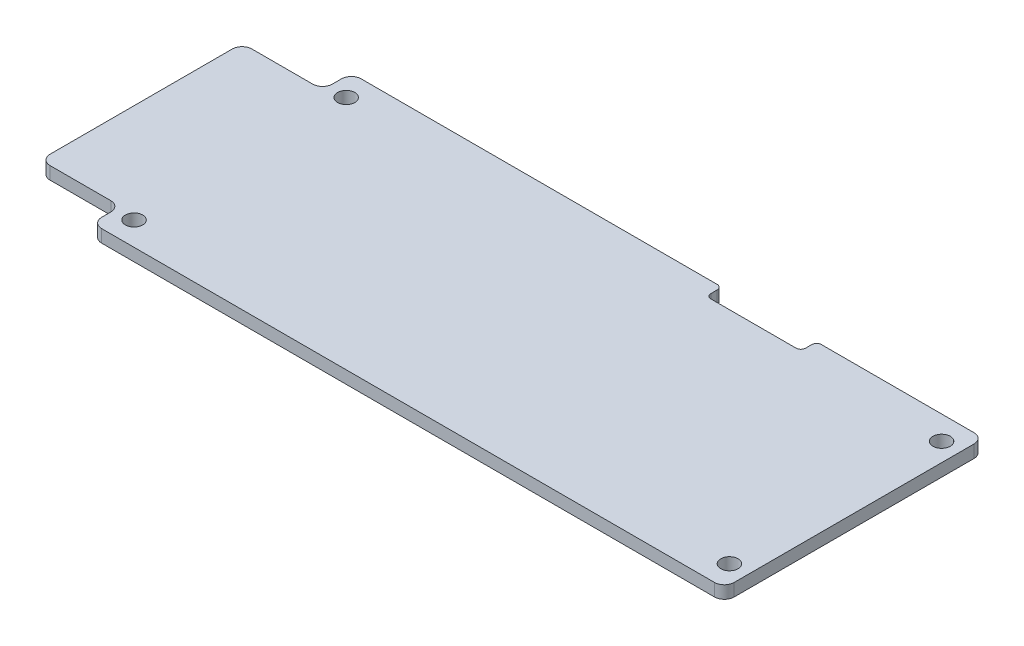
ISO-10303-21;
HEADER;
FILE_DESCRIPTION(('STEP AP214'),'2;1');
FILE_NAME('part.step','',(''),(''),'','','');
FILE_SCHEMA(('AUTOMOTIVE_DESIGN { 1 0 10303 214 1 1 1 1 }'));
ENDSEC;
DATA;
#1=APPLICATION_CONTEXT('core data for automotive mechanical design processes');
#2=APPLICATION_PROTOCOL_DEFINITION('international standard','automotive_design',2000,#1);
#3=PRODUCT_CONTEXT('',#1,'mechanical');
#4=PRODUCT('Part','Part','',(#3));
#5=PRODUCT_RELATED_PRODUCT_CATEGORY('part','',(#4));
#6=PRODUCT_DEFINITION_FORMATION('','',#4);
#7=PRODUCT_DEFINITION_CONTEXT('part definition',#1,'design');
#8=PRODUCT_DEFINITION('design','',#6,#7);
#9=PRODUCT_DEFINITION_SHAPE('','',#8);
#10=(LENGTH_UNIT() NAMED_UNIT(*) SI_UNIT(.MILLI.,.METRE.));
#11=(NAMED_UNIT(*) PLANE_ANGLE_UNIT() SI_UNIT($,.RADIAN.));
#12=(NAMED_UNIT(*) SI_UNIT($,.STERADIAN.) SOLID_ANGLE_UNIT());
#13=UNCERTAINTY_MEASURE_WITH_UNIT(LENGTH_MEASURE(1.E-05),#10,'distance_accuracy_value','');
#14=(GEOMETRIC_REPRESENTATION_CONTEXT(3) GLOBAL_UNCERTAINTY_ASSIGNED_CONTEXT((#13)) GLOBAL_UNIT_ASSIGNED_CONTEXT((#10,
#11,#12)) REPRESENTATION_CONTEXT('',''));
#15=CARTESIAN_POINT('',(0.,0.,0.));
#16=DIRECTION('',(0.,0.,1.));
#17=DIRECTION('',(1.,0.,0.));
#18=AXIS2_PLACEMENT_3D('',#15,#16,#17);
#19=CARTESIAN_POINT('',(78.95,1.6,-1.25));
#20=DIRECTION('',(0.,-1.,0.));
#21=DIRECTION('',(0.,0.,-1.));
#22=AXIS2_PLACEMENT_3D('',#19,#20,#21);
#23=PLANE('',#22);
#24=CARTESIAN_POINT('',(78.95,1.6,-1.25));
#25=DIRECTION('',(0.,1.,0.));
#26=DIRECTION('',(0.,0.,-1.));
#27=AXIS2_PLACEMENT_3D('',#24,#25,#26);
#28=CIRCLE('',#27,1.25000000000001);
#29=CARTESIAN_POINT('',(78.95,1.6,0.));
#30=VERTEX_POINT('',#29);
#31=CARTESIAN_POINT('',(80.2,1.6,-1.25));
#32=VERTEX_POINT('',#31);
#33=EDGE_CURVE('E308',#30,#32,#28,.T.);
#34=ORIENTED_EDGE('',*,*,#33,.T.);
#35=DIRECTION('',(0.,0.,-1.));
#36=VECTOR('',#35,1.);
#37=CARTESIAN_POINT('',(80.2,1.6,-1.25));
#38=LINE('',#37,#36);
#39=CARTESIAN_POINT('',(80.2,1.6,-31.65));
#40=VERTEX_POINT('',#39);
#41=EDGE_CURVE('E148',#32,#40,#38,.T.);
#42=ORIENTED_EDGE('',*,*,#41,.T.);
#43=CARTESIAN_POINT('',(78.95,1.6,-31.65));
#44=DIRECTION('',(0.,1.,0.));
#45=DIRECTION('',(0.,0.,-1.));
#46=AXIS2_PLACEMENT_3D('',#43,#44,#45);
#47=CIRCLE('',#46,1.25);
#48=CARTESIAN_POINT('',(78.95,1.6,-32.9));
#49=VERTEX_POINT('',#48);
#50=EDGE_CURVE('E393',#40,#49,#47,.T.);
#51=ORIENTED_EDGE('',*,*,#50,.T.);
#52=DIRECTION('',(-1.,0.,0.));
#53=VECTOR('',#52,1.);
#54=CARTESIAN_POINT('',(59.6,1.6,-32.9));
#55=LINE('',#54,#53);
#56=CARTESIAN_POINT('',(59.6,1.6,-32.9));
#57=VERTEX_POINT('',#56);
#58=EDGE_CURVE('E413',#49,#57,#55,.T.);
#59=ORIENTED_EDGE('',*,*,#58,.T.);
#60=CARTESIAN_POINT('',(59.6,1.6,-32.3));
#61=DIRECTION('',(0.,1.,0.));
#62=DIRECTION('',(0.,0.,-1.));
#63=AXIS2_PLACEMENT_3D('',#60,#61,#62);
#64=CIRCLE('',#63,0.6);
#65=CARTESIAN_POINT('',(59.,1.6,-32.3));
#66=VERTEX_POINT('',#65);
#67=EDGE_CURVE('E409',#57,#66,#64,.T.);
#68=ORIENTED_EDGE('',*,*,#67,.T.);
#69=DIRECTION('',(0.,0.,1.));
#70=VECTOR('',#69,1.);
#71=CARTESIAN_POINT('',(59.,1.6,-31.5));
#72=LINE('',#71,#70);
#73=CARTESIAN_POINT('',(59.,1.6,-31.5));
#74=VERTEX_POINT('',#73);
#75=EDGE_CURVE('E412',#66,#74,#72,.T.);
#76=ORIENTED_EDGE('',*,*,#75,.T.);
#77=CARTESIAN_POINT('',(58.4,1.6,-31.5));
#78=DIRECTION('',(0.,-1.,0.));
#79=DIRECTION('',(0.,0.,-1.));
#80=AXIS2_PLACEMENT_3D('',#77,#78,#79);
#81=CIRCLE('',#80,0.600000000000003);
#82=CARTESIAN_POINT('',(58.4,1.6,-30.9));
#83=VERTEX_POINT('',#82);
#84=EDGE_CURVE('E417',#74,#83,#81,.T.);
#85=ORIENTED_EDGE('',*,*,#84,.T.);
#86=DIRECTION('',(-1.,0.,0.));
#87=VECTOR('',#86,1.);
#88=CARTESIAN_POINT('',(47.6,1.6,-30.9));
#89=LINE('',#88,#87);
#90=CARTESIAN_POINT('',(47.6,1.6,-30.9));
#91=VERTEX_POINT('',#90);
#92=EDGE_CURVE('E424',#83,#91,#89,.T.);
#93=ORIENTED_EDGE('',*,*,#92,.T.);
#94=CARTESIAN_POINT('',(47.6,1.6,-31.5));
#95=DIRECTION('',(0.,-1.,0.));
#96=DIRECTION('',(0.,0.,-1.));
#97=AXIS2_PLACEMENT_3D('',#94,#95,#96);
#98=CIRCLE('',#97,0.600000000000003);
#99=CARTESIAN_POINT('',(47.,1.6,-31.5));
#100=VERTEX_POINT('',#99);
#101=EDGE_CURVE('E427',#91,#100,#98,.T.);
#102=ORIENTED_EDGE('',*,*,#101,.T.);
#103=DIRECTION('',(0.,0.,-1.));
#104=VECTOR('',#103,1.);
#105=CARTESIAN_POINT('',(47.,1.6,-32.3));
#106=LINE('',#105,#104);
#107=CARTESIAN_POINT('',(47.,1.6,-32.3));
#108=VERTEX_POINT('',#107);
#109=EDGE_CURVE('E430',#100,#108,#106,.T.);
#110=ORIENTED_EDGE('',*,*,#109,.T.);
#111=CARTESIAN_POINT('',(46.4,1.6,-32.3));
#112=DIRECTION('',(0.,1.,0.));
#113=DIRECTION('',(0.,0.,-1.));
#114=AXIS2_PLACEMENT_3D('',#111,#112,#113);
#115=CIRCLE('',#114,0.600000000000003);
#116=CARTESIAN_POINT('',(46.4,1.6,-32.9));
#117=VERTEX_POINT('',#116);
#118=EDGE_CURVE('E433',#108,#117,#115,.T.);
#119=ORIENTED_EDGE('',*,*,#118,.T.);
#120=DIRECTION('',(-1.,0.,0.));
#121=VECTOR('',#120,1.);
#122=CARTESIAN_POINT('',(1.25000000000001,1.6,-32.9));
#123=LINE('',#122,#121);
#124=CARTESIAN_POINT('',(1.25000000000001,1.6,-32.9));
#125=VERTEX_POINT('',#124);
#126=EDGE_CURVE('E436',#117,#125,#123,.T.);
#127=ORIENTED_EDGE('',*,*,#126,.T.);
#128=CARTESIAN_POINT('',(1.25,1.6,-31.65));
#129=DIRECTION('',(0.,1.,0.));
#130=DIRECTION('',(0.,0.,-1.));
#131=AXIS2_PLACEMENT_3D('',#128,#129,#130);
#132=CIRCLE('',#131,1.25);
#133=CARTESIAN_POINT('',(0.,1.6,-31.65));
#134=VERTEX_POINT('',#133);
#135=EDGE_CURVE('E439',#125,#134,#132,.T.);
#136=ORIENTED_EDGE('',*,*,#135,.T.);
#137=DIRECTION('',(0.,0.,1.));
#138=VECTOR('',#137,1.);
#139=CARTESIAN_POINT('',(0.,1.6,-30.5));
#140=LINE('',#139,#138);
#141=CARTESIAN_POINT('',(0.,1.6,-30.5));
#142=VERTEX_POINT('',#141);
#143=EDGE_CURVE('E442',#134,#142,#140,.T.);
#144=ORIENTED_EDGE('',*,*,#143,.T.);
#145=CARTESIAN_POINT('',(-1.25,1.6,-30.5));
#146=DIRECTION('',(0.,-1.,0.));
#147=DIRECTION('',(0.,0.,-1.));
#148=AXIS2_PLACEMENT_3D('',#145,#146,#147);
#149=CIRCLE('',#148,1.25);
#150=CARTESIAN_POINT('',(-1.25000000000001,1.6,-29.25));
#151=VERTEX_POINT('',#150);
#152=EDGE_CURVE('E445',#142,#151,#149,.T.);
#153=ORIENTED_EDGE('',*,*,#152,.T.);
#154=DIRECTION('',(-1.,0.,0.));
#155=VECTOR('',#154,1.);
#156=CARTESIAN_POINT('',(-8.94999999999999,1.6,-29.25));
#157=LINE('',#156,#155);
#158=CARTESIAN_POINT('',(-8.94999999999999,1.6,-29.25));
#159=VERTEX_POINT('',#158);
#160=EDGE_CURVE('E448',#151,#159,#157,.T.);
#161=ORIENTED_EDGE('',*,*,#160,.T.);
#162=CARTESIAN_POINT('',(-8.95,1.6,-28.));
#163=DIRECTION('',(0.,1.,0.));
#164=DIRECTION('',(0.,0.,1.));
#165=AXIS2_PLACEMENT_3D('',#162,#163,#164);
#166=CIRCLE('',#165,1.25);
#167=CARTESIAN_POINT('',(-10.2,1.6,-28.));
#168=VERTEX_POINT('',#167);
#169=EDGE_CURVE('E451',#159,#168,#166,.T.);
#170=ORIENTED_EDGE('',*,*,#169,.T.);
#171=DIRECTION('',(0.,0.,1.));
#172=VECTOR('',#171,1.);
#173=CARTESIAN_POINT('',(-10.2,1.6,-4.90000000000002));
#174=LINE('',#173,#172);
#175=CARTESIAN_POINT('',(-10.2,1.6,-4.90000000000002));
#176=VERTEX_POINT('',#175);
#177=EDGE_CURVE('E454',#168,#176,#174,.T.);
#178=ORIENTED_EDGE('',*,*,#177,.T.);
#179=CARTESIAN_POINT('',(-8.95,1.6,-4.90000000000001));
#180=DIRECTION('',(0.,1.,0.));
#181=DIRECTION('',(0.,0.,1.));
#182=AXIS2_PLACEMENT_3D('',#179,#180,#181);
#183=CIRCLE('',#182,1.25);
#184=CARTESIAN_POINT('',(-8.95,1.6,-3.65000000000001));
#185=VERTEX_POINT('',#184);
#186=EDGE_CURVE('E457',#176,#185,#183,.T.);
#187=ORIENTED_EDGE('',*,*,#186,.T.);
#188=DIRECTION('',(1.,0.,0.));
#189=VECTOR('',#188,1.);
#190=CARTESIAN_POINT('',(-1.25000000000001,1.6,-3.65000000000001));
#191=LINE('',#190,#189);
#192=CARTESIAN_POINT('',(-1.25000000000001,1.6,-3.65000000000001));
#193=VERTEX_POINT('',#192);
#194=EDGE_CURVE('E460',#185,#193,#191,.T.);
#195=ORIENTED_EDGE('',*,*,#194,.T.);
#196=CARTESIAN_POINT('',(-1.25,1.6,-2.40000000000001));
#197=DIRECTION('',(0.,-1.,0.));
#198=DIRECTION('',(0.,0.,-1.));
#199=AXIS2_PLACEMENT_3D('',#196,#197,#198);
#200=CIRCLE('',#199,1.25);
#201=CARTESIAN_POINT('',(0.,1.6,-2.4));
#202=VERTEX_POINT('',#201);
#203=EDGE_CURVE('E215',#193,#202,#200,.T.);
#204=ORIENTED_EDGE('',*,*,#203,.T.);
#205=DIRECTION('',(0.,0.,1.));
#206=VECTOR('',#205,1.);
#207=CARTESIAN_POINT('',(0.,1.6,-1.25000000000001));
#208=LINE('',#207,#206);
#209=CARTESIAN_POINT('',(0.,1.6,-1.25000000000001));
#210=VERTEX_POINT('',#209);
#211=EDGE_CURVE('E209',#202,#210,#208,.T.);
#212=ORIENTED_EDGE('',*,*,#211,.T.);
#213=CARTESIAN_POINT('',(1.25,1.6,-1.25));
#214=DIRECTION('',(0.,1.,0.));
#215=DIRECTION('',(0.,0.,1.));
#216=AXIS2_PLACEMENT_3D('',#213,#214,#215);
#217=CIRCLE('',#216,1.25);
#218=CARTESIAN_POINT('',(1.25,1.6,0.));
#219=VERTEX_POINT('',#218);
#220=EDGE_CURVE('E213',#210,#219,#217,.T.);
#221=ORIENTED_EDGE('',*,*,#220,.T.);
#222=DIRECTION('',(1.,0.,0.));
#223=VECTOR('',#222,1.);
#224=CARTESIAN_POINT('',(1.25000000000001,1.6,0.));
#225=LINE('',#224,#223);
#226=EDGE_CURVE('E57',#219,#30,#225,.T.);
#227=ORIENTED_EDGE('',*,*,#226,.T.);
#228=EDGE_LOOP('',(#34,#42,#51,#59,#68,#76,#85,#93,#102,#110,#119,#127,#136,#144,#153,#161,#170,
#178,#187,#195,#204,#212,#221,#227));
#229=FACE_BOUND('',#228,.T.);
#230=CARTESIAN_POINT('',(2.35,1.6,-29.9));
#231=DIRECTION('',(0.,1.,0.));
#232=DIRECTION('',(0.,0.,1.));
#233=AXIS2_PLACEMENT_3D('',#230,#231,#232);
#234=CIRCLE('',#233,1.1);
#235=CARTESIAN_POINT('',(2.35,1.6,-28.8));
#236=VERTEX_POINT('',#235);
#237=EDGE_CURVE('E242',#236,#236,#234,.T.);
#238=ORIENTED_EDGE('',*,*,#237,.F.);
#239=EDGE_LOOP('',(#238));
#240=FACE_BOUND('',#239,.T.);
#241=CARTESIAN_POINT('',(77.85,1.6,-29.9));
#242=DIRECTION('',(0.,1.,0.));
#243=DIRECTION('',(0.,0.,-1.));
#244=AXIS2_PLACEMENT_3D('',#241,#242,#243);
#245=CIRCLE('',#244,1.10000000000001);
#246=CARTESIAN_POINT('',(77.85,1.6,-31.));
#247=VERTEX_POINT('',#246);
#248=EDGE_CURVE('E530',#247,#247,#245,.T.);
#249=ORIENTED_EDGE('',*,*,#248,.F.);
#250=EDGE_LOOP('',(#249));
#251=FACE_BOUND('',#250,.T.);
#252=CARTESIAN_POINT('',(77.85,1.6,-2.99999999999999));
#253=DIRECTION('',(0.,1.,0.));
#254=DIRECTION('',(0.,0.,1.));
#255=AXIS2_PLACEMENT_3D('',#252,#253,#254);
#256=CIRCLE('',#255,1.10000000000001);
#257=CARTESIAN_POINT('',(77.85,1.6,-1.89999999999998));
#258=VERTEX_POINT('',#257);
#259=EDGE_CURVE('E522',#258,#258,#256,.T.);
#260=ORIENTED_EDGE('',*,*,#259,.F.);
#261=EDGE_LOOP('',(#260));
#262=FACE_BOUND('',#261,.T.);
#263=CARTESIAN_POINT('',(2.35,1.6,-3.));
#264=DIRECTION('',(0.,1.,0.));
#265=DIRECTION('',(0.,0.,-1.));
#266=AXIS2_PLACEMENT_3D('',#263,#264,#265);
#267=CIRCLE('',#266,1.1);
#268=CARTESIAN_POINT('',(2.35,1.6,-4.1));
#269=VERTEX_POINT('',#268);
#270=EDGE_CURVE('E511',#269,#269,#267,.T.);
#271=ORIENTED_EDGE('',*,*,#270,.F.);
#272=EDGE_LOOP('',(#271));
#273=FACE_BOUND('',#272,.T.);
#274=ADVANCED_FACE('F39',(#229,#240,#251,#262,#273),#23,.F.);
#275=CARTESIAN_POINT('',(78.95,0.,-1.25));
#276=DIRECTION('',(0.,-1.,0.));
#277=DIRECTION('',(0.,0.,-1.));
#278=AXIS2_PLACEMENT_3D('',#275,#276,#277);
#279=PLANE('',#278);
#280=CARTESIAN_POINT('',(77.85,0.,-2.99999999999999));
#281=DIRECTION('',(0.,1.,0.));
#282=DIRECTION('',(0.,0.,1.));
#283=AXIS2_PLACEMENT_3D('',#280,#281,#282);
#284=CIRCLE('',#283,1.10000000000001);
#285=CARTESIAN_POINT('',(77.85,0.,-1.89999999999998));
#286=VERTEX_POINT('',#285);
#287=EDGE_CURVE('E519',#286,#286,#284,.T.);
#288=ORIENTED_EDGE('',*,*,#287,.T.);
#289=EDGE_LOOP('',(#288));
#290=FACE_BOUND('',#289,.T.);
#291=CARTESIAN_POINT('',(2.35,0.,-29.9));
#292=DIRECTION('',(0.,1.,0.));
#293=DIRECTION('',(0.,0.,1.));
#294=AXIS2_PLACEMENT_3D('',#291,#292,#293);
#295=CIRCLE('',#294,1.1);
#296=CARTESIAN_POINT('',(2.35,0.,-28.8));
#297=VERTEX_POINT('',#296);
#298=EDGE_CURVE('E534',#297,#297,#295,.T.);
#299=ORIENTED_EDGE('',*,*,#298,.T.);
#300=EDGE_LOOP('',(#299));
#301=FACE_BOUND('',#300,.T.);
#302=CARTESIAN_POINT('',(78.95,0.,-1.25));
#303=DIRECTION('',(0.,1.,0.));
#304=DIRECTION('',(0.,0.,-1.));
#305=AXIS2_PLACEMENT_3D('',#302,#303,#304);
#306=CIRCLE('',#305,1.25000000000001);
#307=CARTESIAN_POINT('',(78.95,0.,0.));
#308=VERTEX_POINT('',#307);
#309=CARTESIAN_POINT('',(80.2,0.,-1.25));
#310=VERTEX_POINT('',#309);
#311=EDGE_CURVE('E237',#308,#310,#306,.T.);
#312=ORIENTED_EDGE('',*,*,#311,.F.);
#313=DIRECTION('',(1.,0.,0.));
#314=VECTOR('',#313,1.);
#315=CARTESIAN_POINT('',(1.25000000000001,0.,0.));
#316=LINE('',#315,#314);
#317=CARTESIAN_POINT('',(1.25,0.,0.));
#318=VERTEX_POINT('',#317);
#319=EDGE_CURVE('E140',#318,#308,#316,.T.);
#320=ORIENTED_EDGE('',*,*,#319,.F.);
#321=CARTESIAN_POINT('',(1.25,0.,-1.25));
#322=DIRECTION('',(0.,1.,0.));
#323=DIRECTION('',(0.,0.,1.));
#324=AXIS2_PLACEMENT_3D('',#321,#322,#323);
#325=CIRCLE('',#324,1.25);
#326=CARTESIAN_POINT('',(0.,0.,-1.25000000000001));
#327=VERTEX_POINT('',#326);
#328=EDGE_CURVE('E134',#327,#318,#325,.T.);
#329=ORIENTED_EDGE('',*,*,#328,.F.);
#330=DIRECTION('',(0.,0.,1.));
#331=VECTOR('',#330,1.);
#332=CARTESIAN_POINT('',(0.,0.,-1.25000000000001));
#333=LINE('',#332,#331);
#334=CARTESIAN_POINT('',(0.,0.,-2.4));
#335=VERTEX_POINT('',#334);
#336=EDGE_CURVE('E224',#335,#327,#333,.T.);
#337=ORIENTED_EDGE('',*,*,#336,.F.);
#338=CARTESIAN_POINT('',(-1.25,0.,-2.40000000000001));
#339=DIRECTION('',(0.,-1.,0.));
#340=DIRECTION('',(0.,0.,-1.));
#341=AXIS2_PLACEMENT_3D('',#338,#339,#340);
#342=CIRCLE('',#341,1.25);
#343=CARTESIAN_POINT('',(-1.25000000000001,0.,-3.65000000000001));
#344=VERTEX_POINT('',#343);
#345=EDGE_CURVE('E299',#344,#335,#342,.T.);
#346=ORIENTED_EDGE('',*,*,#345,.F.);
#347=DIRECTION('',(1.,0.,0.));
#348=VECTOR('',#347,1.);
#349=CARTESIAN_POINT('',(-1.25000000000001,0.,-3.65000000000001));
#350=LINE('',#349,#348);
#351=CARTESIAN_POINT('',(-8.95,0.,-3.65000000000001));
#352=VERTEX_POINT('',#351);
#353=EDGE_CURVE('E296',#352,#344,#350,.T.);
#354=ORIENTED_EDGE('',*,*,#353,.F.);
#355=CARTESIAN_POINT('',(-8.95,0.,-4.90000000000001));
#356=DIRECTION('',(0.,1.,0.));
#357=DIRECTION('',(0.,0.,1.));
#358=AXIS2_PLACEMENT_3D('',#355,#356,#357);
#359=CIRCLE('',#358,1.25);
#360=CARTESIAN_POINT('',(-10.2,0.,-4.90000000000002));
#361=VERTEX_POINT('',#360);
#362=EDGE_CURVE('E293',#361,#352,#359,.T.);
#363=ORIENTED_EDGE('',*,*,#362,.F.);
#364=DIRECTION('',(0.,0.,1.));
#365=VECTOR('',#364,1.);
#366=CARTESIAN_POINT('',(-10.2,0.,-4.90000000000002));
#367=LINE('',#366,#365);
#368=CARTESIAN_POINT('',(-10.2,0.,-28.));
#369=VERTEX_POINT('',#368);
#370=EDGE_CURVE('E290',#369,#361,#367,.T.);
#371=ORIENTED_EDGE('',*,*,#370,.F.);
#372=CARTESIAN_POINT('',(-8.95,0.,-28.));
#373=DIRECTION('',(0.,1.,0.));
#374=DIRECTION('',(0.,0.,1.));
#375=AXIS2_PLACEMENT_3D('',#372,#373,#374);
#376=CIRCLE('',#375,1.25);
#377=CARTESIAN_POINT('',(-8.94999999999999,0.,-29.25));
#378=VERTEX_POINT('',#377);
#379=EDGE_CURVE('E287',#378,#369,#376,.T.);
#380=ORIENTED_EDGE('',*,*,#379,.F.);
#381=DIRECTION('',(-1.,0.,0.));
#382=VECTOR('',#381,1.);
#383=CARTESIAN_POINT('',(-8.94999999999999,0.,-29.25));
#384=LINE('',#383,#382);
#385=CARTESIAN_POINT('',(-1.25000000000001,0.,-29.25));
#386=VERTEX_POINT('',#385);
#387=EDGE_CURVE('E284',#386,#378,#384,.T.);
#388=ORIENTED_EDGE('',*,*,#387,.F.);
#389=CARTESIAN_POINT('',(-1.25,0.,-30.5));
#390=DIRECTION('',(0.,-1.,0.));
#391=DIRECTION('',(0.,0.,-1.));
#392=AXIS2_PLACEMENT_3D('',#389,#390,#391);
#393=CIRCLE('',#392,1.25);
#394=CARTESIAN_POINT('',(0.,0.,-30.5));
#395=VERTEX_POINT('',#394);
#396=EDGE_CURVE('E281',#395,#386,#393,.T.);
#397=ORIENTED_EDGE('',*,*,#396,.F.);
#398=DIRECTION('',(0.,0.,1.));
#399=VECTOR('',#398,1.);
#400=CARTESIAN_POINT('',(0.,0.,-30.5));
#401=LINE('',#400,#399);
#402=CARTESIAN_POINT('',(0.,0.,-31.65));
#403=VERTEX_POINT('',#402);
#404=EDGE_CURVE('E278',#403,#395,#401,.T.);
#405=ORIENTED_EDGE('',*,*,#404,.F.);
#406=CARTESIAN_POINT('',(1.25,0.,-31.65));
#407=DIRECTION('',(0.,1.,0.));
#408=DIRECTION('',(0.,0.,-1.));
#409=AXIS2_PLACEMENT_3D('',#406,#407,#408);
#410=CIRCLE('',#409,1.25);
#411=CARTESIAN_POINT('',(1.25000000000001,0.,-32.9));
#412=VERTEX_POINT('',#411);
#413=EDGE_CURVE('E275',#412,#403,#410,.T.);
#414=ORIENTED_EDGE('',*,*,#413,.F.);
#415=DIRECTION('',(-1.,0.,0.));
#416=VECTOR('',#415,1.);
#417=CARTESIAN_POINT('',(1.25000000000001,0.,-32.9));
#418=LINE('',#417,#416);
#419=CARTESIAN_POINT('',(46.4,0.,-32.9));
#420=VERTEX_POINT('',#419);
#421=EDGE_CURVE('E272',#420,#412,#418,.T.);
#422=ORIENTED_EDGE('',*,*,#421,.F.);
#423=CARTESIAN_POINT('',(46.4,0.,-32.3));
#424=DIRECTION('',(0.,1.,0.));
#425=DIRECTION('',(0.,0.,-1.));
#426=AXIS2_PLACEMENT_3D('',#423,#424,#425);
#427=CIRCLE('',#426,0.600000000000003);
#428=CARTESIAN_POINT('',(47.,0.,-32.3));
#429=VERTEX_POINT('',#428);
#430=EDGE_CURVE('E269',#429,#420,#427,.T.);
#431=ORIENTED_EDGE('',*,*,#430,.F.);
#432=DIRECTION('',(0.,0.,-1.));
#433=VECTOR('',#432,1.);
#434=CARTESIAN_POINT('',(47.,0.,-32.3));
#435=LINE('',#434,#433);
#436=CARTESIAN_POINT('',(47.,0.,-31.5));
#437=VERTEX_POINT('',#436);
#438=EDGE_CURVE('E266',#437,#429,#435,.T.);
#439=ORIENTED_EDGE('',*,*,#438,.F.);
#440=CARTESIAN_POINT('',(47.6,0.,-31.5));
#441=DIRECTION('',(0.,-1.,0.));
#442=DIRECTION('',(0.,0.,-1.));
#443=AXIS2_PLACEMENT_3D('',#440,#441,#442);
#444=CIRCLE('',#443,0.600000000000003);
#445=CARTESIAN_POINT('',(47.6,0.,-30.9));
#446=VERTEX_POINT('',#445);
#447=EDGE_CURVE('E263',#446,#437,#444,.T.);
#448=ORIENTED_EDGE('',*,*,#447,.F.);
#449=DIRECTION('',(-1.,0.,0.));
#450=VECTOR('',#449,1.);
#451=CARTESIAN_POINT('',(47.6,0.,-30.9));
#452=LINE('',#451,#450);
#453=CARTESIAN_POINT('',(58.4,0.,-30.9));
#454=VERTEX_POINT('',#453);
#455=EDGE_CURVE('E260',#454,#446,#452,.T.);
#456=ORIENTED_EDGE('',*,*,#455,.F.);
#457=CARTESIAN_POINT('',(58.4,0.,-31.5));
#458=DIRECTION('',(0.,-1.,0.));
#459=DIRECTION('',(0.,0.,-1.));
#460=AXIS2_PLACEMENT_3D('',#457,#458,#459);
#461=CIRCLE('',#460,0.600000000000003);
#462=CARTESIAN_POINT('',(59.,0.,-31.5));
#463=VERTEX_POINT('',#462);
#464=EDGE_CURVE('E257',#463,#454,#461,.T.);
#465=ORIENTED_EDGE('',*,*,#464,.F.);
#466=DIRECTION('',(0.,0.,1.));
#467=VECTOR('',#466,1.);
#468=CARTESIAN_POINT('',(59.,0.,-31.5));
#469=LINE('',#468,#467);
#470=CARTESIAN_POINT('',(59.,0.,-32.3));
#471=VERTEX_POINT('',#470);
#472=EDGE_CURVE('E254',#471,#463,#469,.T.);
#473=ORIENTED_EDGE('',*,*,#472,.F.);
#474=CARTESIAN_POINT('',(59.6,0.,-32.3));
#475=DIRECTION('',(0.,1.,0.));
#476=DIRECTION('',(0.,0.,-1.));
#477=AXIS2_PLACEMENT_3D('',#474,#475,#476);
#478=CIRCLE('',#477,0.6);
#479=CARTESIAN_POINT('',(59.6,0.,-32.9));
#480=VERTEX_POINT('',#479);
#481=EDGE_CURVE('E251',#480,#471,#478,.T.);
#482=ORIENTED_EDGE('',*,*,#481,.F.);
#483=DIRECTION('',(-1.,0.,0.));
#484=VECTOR('',#483,1.);
#485=CARTESIAN_POINT('',(59.6,0.,-32.9));
#486=LINE('',#485,#484);
#487=CARTESIAN_POINT('',(78.95,0.,-32.9));
#488=VERTEX_POINT('',#487);
#489=EDGE_CURVE('E248',#488,#480,#486,.T.);
#490=ORIENTED_EDGE('',*,*,#489,.F.);
#491=CARTESIAN_POINT('',(78.95,0.,-31.65));
#492=DIRECTION('',(0.,1.,0.));
#493=DIRECTION('',(0.,0.,-1.));
#494=AXIS2_PLACEMENT_3D('',#491,#492,#493);
#495=CIRCLE('',#494,1.25);
#496=CARTESIAN_POINT('',(80.2,0.,-31.65));
#497=VERTEX_POINT('',#496);
#498=EDGE_CURVE('E245',#497,#488,#495,.T.);
#499=ORIENTED_EDGE('',*,*,#498,.F.);
#500=DIRECTION('',(0.,0.,-1.));
#501=VECTOR('',#500,1.);
#502=CARTESIAN_POINT('',(80.2,0.,-1.25));
#503=LINE('',#502,#501);
#504=EDGE_CURVE('E241',#310,#497,#503,.T.);
#505=ORIENTED_EDGE('',*,*,#504,.F.);
#506=EDGE_LOOP('',(#312,#320,#329,#337,#346,#354,#363,#371,#380,#388,#397,#405,#414,#422,#431,
#439,#448,#456,#465,#473,#482,#490,#499,#505));
#507=FACE_BOUND('',#506,.T.);
#508=CARTESIAN_POINT('',(77.85,0.,-29.9));
#509=DIRECTION('',(0.,1.,0.));
#510=DIRECTION('',(0.,0.,-1.));
#511=AXIS2_PLACEMENT_3D('',#508,#509,#510);
#512=CIRCLE('',#511,1.10000000000001);
#513=CARTESIAN_POINT('',(77.85,0.,-31.));
#514=VERTEX_POINT('',#513);
#515=EDGE_CURVE('E526',#514,#514,#512,.T.);
#516=ORIENTED_EDGE('',*,*,#515,.T.);
#517=EDGE_LOOP('',(#516));
#518=FACE_BOUND('',#517,.T.);
#519=CARTESIAN_POINT('',(2.35,0.,-3.));
#520=DIRECTION('',(0.,1.,0.));
#521=DIRECTION('',(0.,0.,-1.));
#522=AXIS2_PLACEMENT_3D('',#519,#520,#521);
#523=CIRCLE('',#522,1.1);
#524=CARTESIAN_POINT('',(2.35,0.,-4.1));
#525=VERTEX_POINT('',#524);
#526=EDGE_CURVE('E514',#525,#525,#523,.T.);
#527=ORIENTED_EDGE('',*,*,#526,.T.);
#528=EDGE_LOOP('',(#527));
#529=FACE_BOUND('',#528,.T.);
#530=ADVANCED_FACE('F397',(#290,#301,#507,#518,#529),#279,.T.);
#531=CARTESIAN_POINT('',(78.95,1.6,-1.25));
#532=DIRECTION('',(0.,-1.,0.));
#533=DIRECTION('',(0.,0.,-1.));
#534=AXIS2_PLACEMENT_3D('',#531,#532,#533);
#535=CYLINDRICAL_SURFACE('',#534,1.25000000000001);
#536=ORIENTED_EDGE('',*,*,#311,.T.);
#537=DIRECTION('',(0.,-1.,0.));
#538=VECTOR('',#537,1.);
#539=CARTESIAN_POINT('',(80.2,1.6,-1.25));
#540=LINE('',#539,#538);
#541=EDGE_CURVE('E11',#32,#310,#540,.T.);
#542=ORIENTED_EDGE('',*,*,#541,.F.);
#543=ORIENTED_EDGE('',*,*,#33,.F.);
#544=DIRECTION('',(0.,-1.,0.));
#545=VECTOR('',#544,1.);
#546=CARTESIAN_POINT('',(78.95,1.6,0.));
#547=LINE('',#546,#545);
#548=EDGE_CURVE('E233',#30,#308,#547,.T.);
#549=ORIENTED_EDGE('',*,*,#548,.T.);
#550=EDGE_LOOP('',(#536,#542,#543,#549));
#551=FACE_BOUND('',#550,.T.);
#552=ADVANCED_FACE('F41',(#551),#535,.T.);
#553=CARTESIAN_POINT('',(80.2,1.6,-1.25));
#554=DIRECTION('',(-1.,0.,0.));
#555=DIRECTION('',(0.,0.,1.));
#556=AXIS2_PLACEMENT_3D('',#553,#554,#555);
#557=PLANE('',#556);
#558=ORIENTED_EDGE('',*,*,#504,.T.);
#559=DIRECTION('',(0.,-1.,0.));
#560=VECTOR('',#559,1.);
#561=CARTESIAN_POINT('',(80.2,1.6,-31.65));
#562=LINE('',#561,#560);
#563=EDGE_CURVE('E49',#40,#497,#562,.T.);
#564=ORIENTED_EDGE('',*,*,#563,.F.);
#565=ORIENTED_EDGE('',*,*,#41,.F.);
#566=ORIENTED_EDGE('',*,*,#541,.T.);
#567=EDGE_LOOP('',(#558,#564,#565,#566));
#568=FACE_BOUND('',#567,.T.);
#569=ADVANCED_FACE('F772',(#568),#557,.F.);
#570=CARTESIAN_POINT('',(78.95,1.6,-31.65));
#571=DIRECTION('',(0.,-1.,0.));
#572=DIRECTION('',(0.,0.,-1.));
#573=AXIS2_PLACEMENT_3D('',#570,#571,#572);
#574=CYLINDRICAL_SURFACE('',#573,1.25);
#575=ORIENTED_EDGE('',*,*,#498,.T.);
#576=DIRECTION('',(0.,-1.,0.));
#577=VECTOR('',#576,1.);
#578=CARTESIAN_POINT('',(78.95,1.6,-32.9));
#579=LINE('',#578,#577);
#580=EDGE_CURVE('E383',#49,#488,#579,.T.);
#581=ORIENTED_EDGE('',*,*,#580,.F.);
#582=ORIENTED_EDGE('',*,*,#50,.F.);
#583=ORIENTED_EDGE('',*,*,#563,.T.);
#584=EDGE_LOOP('',(#575,#581,#582,#583));
#585=FACE_BOUND('',#584,.T.);
#586=ADVANCED_FACE('F391',(#585),#574,.T.);
#587=CARTESIAN_POINT('',(59.6,1.6,-32.9));
#588=DIRECTION('',(0.,0.,1.));
#589=DIRECTION('',(1.,0.,0.));
#590=AXIS2_PLACEMENT_3D('',#587,#588,#589);
#591=PLANE('',#590);
#592=ORIENTED_EDGE('',*,*,#489,.T.);
#593=DIRECTION('',(0.,-1.,0.));
#594=VECTOR('',#593,1.);
#595=CARTESIAN_POINT('',(59.6,1.6,-32.9));
#596=LINE('',#595,#594);
#597=EDGE_CURVE('E379',#57,#480,#596,.T.);
#598=ORIENTED_EDGE('',*,*,#597,.F.);
#599=ORIENTED_EDGE('',*,*,#58,.F.);
#600=ORIENTED_EDGE('',*,*,#580,.T.);
#601=EDGE_LOOP('',(#592,#598,#599,#600));
#602=FACE_BOUND('',#601,.T.);
#603=ADVANCED_FACE('F403',(#602),#591,.F.);
#604=CARTESIAN_POINT('',(59.6,1.6,-32.3));
#605=DIRECTION('',(0.,-1.,0.));
#606=DIRECTION('',(0.,0.,-1.));
#607=AXIS2_PLACEMENT_3D('',#604,#605,#606);
#608=CYLINDRICAL_SURFACE('',#607,0.6);
#609=ORIENTED_EDGE('',*,*,#481,.T.);
#610=DIRECTION('',(0.,-1.,0.));
#611=VECTOR('',#610,1.);
#612=CARTESIAN_POINT('',(59.,1.6,-32.3));
#613=LINE('',#612,#611);
#614=EDGE_CURVE('E375',#66,#471,#613,.T.);
#615=ORIENTED_EDGE('',*,*,#614,.F.);
#616=ORIENTED_EDGE('',*,*,#67,.F.);
#617=ORIENTED_EDGE('',*,*,#597,.T.);
#618=EDGE_LOOP('',(#609,#615,#616,#617));
#619=FACE_BOUND('',#618,.T.);
#620=ADVANCED_FACE('F407',(#619),#608,.T.);
#621=CARTESIAN_POINT('',(59.,1.6,-31.5));
#622=DIRECTION('',(1.,0.,0.));
#623=DIRECTION('',(0.,0.,-1.));
#624=AXIS2_PLACEMENT_3D('',#621,#622,#623);
#625=PLANE('',#624);
#626=ORIENTED_EDGE('',*,*,#472,.T.);
#627=DIRECTION('',(0.,-1.,0.));
#628=VECTOR('',#627,1.);
#629=CARTESIAN_POINT('',(59.,1.6,-31.5));
#630=LINE('',#629,#628);
#631=EDGE_CURVE('E371',#74,#463,#630,.T.);
#632=ORIENTED_EDGE('',*,*,#631,.F.);
#633=ORIENTED_EDGE('',*,*,#75,.F.);
#634=ORIENTED_EDGE('',*,*,#614,.T.);
#635=EDGE_LOOP('',(#626,#632,#633,#634));
#636=FACE_BOUND('',#635,.T.);
#637=ADVANCED_FACE('F737',(#636),#625,.F.);
#638=CARTESIAN_POINT('',(58.4,1.6,-31.5));
#639=DIRECTION('',(0.,-1.,0.));
#640=DIRECTION('',(0.,0.,-1.));
#641=AXIS2_PLACEMENT_3D('',#638,#639,#640);
#642=CYLINDRICAL_SURFACE('',#641,0.600000000000003);
#643=ORIENTED_EDGE('',*,*,#464,.T.);
#644=DIRECTION('',(0.,-1.,0.));
#645=VECTOR('',#644,1.);
#646=CARTESIAN_POINT('',(58.4,1.6,-30.9));
#647=LINE('',#646,#645);
#648=EDGE_CURVE('E367',#83,#454,#647,.T.);
#649=ORIENTED_EDGE('',*,*,#648,.F.);
#650=ORIENTED_EDGE('',*,*,#84,.F.);
#651=ORIENTED_EDGE('',*,*,#631,.T.);
#652=EDGE_LOOP('',(#643,#649,#650,#651));
#653=FACE_BOUND('',#652,.T.);
#654=ADVANCED_FACE('F727',(#653),#642,.F.);
#655=CARTESIAN_POINT('',(47.6,1.6,-30.9));
#656=DIRECTION('',(0.,0.,1.));
#657=DIRECTION('',(1.,0.,0.));
#658=AXIS2_PLACEMENT_3D('',#655,#656,#657);
#659=PLANE('',#658);
#660=ORIENTED_EDGE('',*,*,#455,.T.);
#661=DIRECTION('',(0.,-1.,0.));
#662=VECTOR('',#661,1.);
#663=CARTESIAN_POINT('',(47.6,1.6,-30.9));
#664=LINE('',#663,#662);
#665=EDGE_CURVE('E363',#91,#446,#664,.T.);
#666=ORIENTED_EDGE('',*,*,#665,.F.);
#667=ORIENTED_EDGE('',*,*,#92,.F.);
#668=ORIENTED_EDGE('',*,*,#648,.T.);
#669=EDGE_LOOP('',(#660,#666,#667,#668));
#670=FACE_BOUND('',#669,.T.);
#671=ADVANCED_FACE('F717',(#670),#659,.F.);
#672=CARTESIAN_POINT('',(47.6,1.6,-31.5));
#673=DIRECTION('',(0.,-1.,0.));
#674=DIRECTION('',(0.,0.,-1.));
#675=AXIS2_PLACEMENT_3D('',#672,#673,#674);
#676=CYLINDRICAL_SURFACE('',#675,0.600000000000003);
#677=ORIENTED_EDGE('',*,*,#447,.T.);
#678=DIRECTION('',(0.,-1.,0.));
#679=VECTOR('',#678,1.);
#680=CARTESIAN_POINT('',(47.,1.6,-31.5));
#681=LINE('',#680,#679);
#682=EDGE_CURVE('E359',#100,#437,#681,.T.);
#683=ORIENTED_EDGE('',*,*,#682,.F.);
#684=ORIENTED_EDGE('',*,*,#101,.F.);
#685=ORIENTED_EDGE('',*,*,#665,.T.);
#686=EDGE_LOOP('',(#677,#683,#684,#685));
#687=FACE_BOUND('',#686,.T.);
#688=ADVANCED_FACE('F707',(#687),#676,.F.);
#689=CARTESIAN_POINT('',(47.,1.6,-32.3));
#690=DIRECTION('',(-1.,0.,0.));
#691=DIRECTION('',(0.,0.,1.));
#692=AXIS2_PLACEMENT_3D('',#689,#690,#691);
#693=PLANE('',#692);
#694=ORIENTED_EDGE('',*,*,#438,.T.);
#695=DIRECTION('',(0.,-1.,0.));
#696=VECTOR('',#695,1.);
#697=CARTESIAN_POINT('',(47.,1.6,-32.3));
#698=LINE('',#697,#696);
#699=EDGE_CURVE('E355',#108,#429,#698,.T.);
#700=ORIENTED_EDGE('',*,*,#699,.F.);
#701=ORIENTED_EDGE('',*,*,#109,.F.);
#702=ORIENTED_EDGE('',*,*,#682,.T.);
#703=EDGE_LOOP('',(#694,#700,#701,#702));
#704=FACE_BOUND('',#703,.T.);
#705=ADVANCED_FACE('F697',(#704),#693,.F.);
#706=CARTESIAN_POINT('',(46.4,1.6,-32.3));
#707=DIRECTION('',(0.,-1.,0.));
#708=DIRECTION('',(0.,0.,-1.));
#709=AXIS2_PLACEMENT_3D('',#706,#707,#708);
#710=CYLINDRICAL_SURFACE('',#709,0.600000000000003);
#711=ORIENTED_EDGE('',*,*,#430,.T.);
#712=DIRECTION('',(0.,-1.,0.));
#713=VECTOR('',#712,1.);
#714=CARTESIAN_POINT('',(46.4,1.6,-32.9));
#715=LINE('',#714,#713);
#716=EDGE_CURVE('E351',#117,#420,#715,.T.);
#717=ORIENTED_EDGE('',*,*,#716,.F.);
#718=ORIENTED_EDGE('',*,*,#118,.F.);
#719=ORIENTED_EDGE('',*,*,#699,.T.);
#720=EDGE_LOOP('',(#711,#717,#718,#719));
#721=FACE_BOUND('',#720,.T.);
#722=ADVANCED_FACE('F687',(#721),#710,.T.);
#723=CARTESIAN_POINT('',(1.25000000000001,1.6,-32.9));
#724=DIRECTION('',(0.,0.,1.));
#725=DIRECTION('',(1.,0.,0.));
#726=AXIS2_PLACEMENT_3D('',#723,#724,#725);
#727=PLANE('',#726);
#728=ORIENTED_EDGE('',*,*,#421,.T.);
#729=DIRECTION('',(0.,-1.,0.));
#730=VECTOR('',#729,1.);
#731=CARTESIAN_POINT('',(1.25000000000001,1.6,-32.9));
#732=LINE('',#731,#730);
#733=EDGE_CURVE('E347',#125,#412,#732,.T.);
#734=ORIENTED_EDGE('',*,*,#733,.F.);
#735=ORIENTED_EDGE('',*,*,#126,.F.);
#736=ORIENTED_EDGE('',*,*,#716,.T.);
#737=EDGE_LOOP('',(#728,#734,#735,#736));
#738=FACE_BOUND('',#737,.T.);
#739=ADVANCED_FACE('F677',(#738),#727,.F.);
#740=CARTESIAN_POINT('',(1.25,1.6,-31.65));
#741=DIRECTION('',(0.,-1.,0.));
#742=DIRECTION('',(0.,0.,-1.));
#743=AXIS2_PLACEMENT_3D('',#740,#741,#742);
#744=CYLINDRICAL_SURFACE('',#743,1.25);
#745=ORIENTED_EDGE('',*,*,#413,.T.);
#746=DIRECTION('',(0.,-1.,0.));
#747=VECTOR('',#746,1.);
#748=CARTESIAN_POINT('',(0.,1.6,-31.65));
#749=LINE('',#748,#747);
#750=EDGE_CURVE('E343',#134,#403,#749,.T.);
#751=ORIENTED_EDGE('',*,*,#750,.F.);
#752=ORIENTED_EDGE('',*,*,#135,.F.);
#753=ORIENTED_EDGE('',*,*,#733,.T.);
#754=EDGE_LOOP('',(#745,#751,#752,#753));
#755=FACE_BOUND('',#754,.T.);
#756=ADVANCED_FACE('F667',(#755),#744,.T.);
#757=CARTESIAN_POINT('',(0.,1.6,-30.5));
#758=DIRECTION('',(1.,0.,0.));
#759=DIRECTION('',(0.,0.,-1.));
#760=AXIS2_PLACEMENT_3D('',#757,#758,#759);
#761=PLANE('',#760);
#762=ORIENTED_EDGE('',*,*,#404,.T.);
#763=DIRECTION('',(0.,-1.,0.));
#764=VECTOR('',#763,1.);
#765=CARTESIAN_POINT('',(0.,1.6,-30.5));
#766=LINE('',#765,#764);
#767=EDGE_CURVE('E339',#142,#395,#766,.T.);
#768=ORIENTED_EDGE('',*,*,#767,.F.);
#769=ORIENTED_EDGE('',*,*,#143,.F.);
#770=ORIENTED_EDGE('',*,*,#750,.T.);
#771=EDGE_LOOP('',(#762,#768,#769,#770));
#772=FACE_BOUND('',#771,.T.);
#773=ADVANCED_FACE('F657',(#772),#761,.F.);
#774=CARTESIAN_POINT('',(-1.25,1.6,-30.5));
#775=DIRECTION('',(0.,-1.,0.));
#776=DIRECTION('',(0.,0.,-1.));
#777=AXIS2_PLACEMENT_3D('',#774,#775,#776);
#778=CYLINDRICAL_SURFACE('',#777,1.25);
#779=ORIENTED_EDGE('',*,*,#396,.T.);
#780=DIRECTION('',(0.,-1.,0.));
#781=VECTOR('',#780,1.);
#782=CARTESIAN_POINT('',(-1.25000000000001,1.6,-29.25));
#783=LINE('',#782,#781);
#784=EDGE_CURVE('E335',#151,#386,#783,.T.);
#785=ORIENTED_EDGE('',*,*,#784,.F.);
#786=ORIENTED_EDGE('',*,*,#152,.F.);
#787=ORIENTED_EDGE('',*,*,#767,.T.);
#788=EDGE_LOOP('',(#779,#785,#786,#787));
#789=FACE_BOUND('',#788,.T.);
#790=ADVANCED_FACE('F647',(#789),#778,.F.);
#791=CARTESIAN_POINT('',(-8.94999999999999,1.6,-29.25));
#792=DIRECTION('',(0.,0.,1.));
#793=DIRECTION('',(1.,0.,0.));
#794=AXIS2_PLACEMENT_3D('',#791,#792,#793);
#795=PLANE('',#794);
#796=ORIENTED_EDGE('',*,*,#387,.T.);
#797=DIRECTION('',(0.,-1.,0.));
#798=VECTOR('',#797,1.);
#799=CARTESIAN_POINT('',(-8.94999999999999,1.6,-29.25));
#800=LINE('',#799,#798);
#801=EDGE_CURVE('E331',#159,#378,#800,.T.);
#802=ORIENTED_EDGE('',*,*,#801,.F.);
#803=ORIENTED_EDGE('',*,*,#160,.F.);
#804=ORIENTED_EDGE('',*,*,#784,.T.);
#805=EDGE_LOOP('',(#796,#802,#803,#804));
#806=FACE_BOUND('',#805,.T.);
#807=ADVANCED_FACE('F637',(#806),#795,.F.);
#808=CARTESIAN_POINT('',(-8.95,1.6,-28.));
#809=DIRECTION('',(0.,-1.,0.));
#810=DIRECTION('',(0.,0.,-1.));
#811=AXIS2_PLACEMENT_3D('',#808,#809,#810);
#812=CYLINDRICAL_SURFACE('',#811,1.25);
#813=ORIENTED_EDGE('',*,*,#379,.T.);
#814=DIRECTION('',(0.,-1.,0.));
#815=VECTOR('',#814,1.);
#816=CARTESIAN_POINT('',(-10.2,1.6,-28.));
#817=LINE('',#816,#815);
#818=EDGE_CURVE('E327',#168,#369,#817,.T.);
#819=ORIENTED_EDGE('',*,*,#818,.F.);
#820=ORIENTED_EDGE('',*,*,#169,.F.);
#821=ORIENTED_EDGE('',*,*,#801,.T.);
#822=EDGE_LOOP('',(#813,#819,#820,#821));
#823=FACE_BOUND('',#822,.T.);
#824=ADVANCED_FACE('F627',(#823),#812,.T.);
#825=CARTESIAN_POINT('',(-10.2,1.6,-4.90000000000002));
#826=DIRECTION('',(1.,0.,0.));
#827=DIRECTION('',(0.,0.,-1.));
#828=AXIS2_PLACEMENT_3D('',#825,#826,#827);
#829=PLANE('',#828);
#830=ORIENTED_EDGE('',*,*,#370,.T.);
#831=DIRECTION('',(0.,-1.,0.));
#832=VECTOR('',#831,1.);
#833=CARTESIAN_POINT('',(-10.2,1.6,-4.90000000000002));
#834=LINE('',#833,#832);
#835=EDGE_CURVE('E323',#176,#361,#834,.T.);
#836=ORIENTED_EDGE('',*,*,#835,.F.);
#837=ORIENTED_EDGE('',*,*,#177,.F.);
#838=ORIENTED_EDGE('',*,*,#818,.T.);
#839=EDGE_LOOP('',(#830,#836,#837,#838));
#840=FACE_BOUND('',#839,.T.);
#841=ADVANCED_FACE('F617',(#840),#829,.F.);
#842=CARTESIAN_POINT('',(-8.95,1.6,-4.90000000000001));
#843=DIRECTION('',(0.,-1.,0.));
#844=DIRECTION('',(0.,0.,-1.));
#845=AXIS2_PLACEMENT_3D('',#842,#843,#844);
#846=CYLINDRICAL_SURFACE('',#845,1.25);
#847=ORIENTED_EDGE('',*,*,#362,.T.);
#848=DIRECTION('',(0.,-1.,0.));
#849=VECTOR('',#848,1.);
#850=CARTESIAN_POINT('',(-8.95,1.6,-3.65000000000001));
#851=LINE('',#850,#849);
#852=EDGE_CURVE('E319',#185,#352,#851,.T.);
#853=ORIENTED_EDGE('',*,*,#852,.F.);
#854=ORIENTED_EDGE('',*,*,#186,.F.);
#855=ORIENTED_EDGE('',*,*,#835,.T.);
#856=EDGE_LOOP('',(#847,#853,#854,#855));
#857=FACE_BOUND('',#856,.T.);
#858=ADVANCED_FACE('F608',(#857),#846,.T.);
#859=CARTESIAN_POINT('',(-1.25000000000001,1.6,-3.65000000000001));
#860=DIRECTION('',(0.,0.,-1.));
#861=DIRECTION('',(-1.,0.,0.));
#862=AXIS2_PLACEMENT_3D('',#859,#860,#861);
#863=PLANE('',#862);
#864=ORIENTED_EDGE('',*,*,#353,.T.);
#865=DIRECTION('',(0.,-1.,0.));
#866=VECTOR('',#865,1.);
#867=CARTESIAN_POINT('',(-1.25000000000001,1.6,-3.65000000000001));
#868=LINE('',#867,#866);
#869=EDGE_CURVE('E315',#193,#344,#868,.T.);
#870=ORIENTED_EDGE('',*,*,#869,.F.);
#871=ORIENTED_EDGE('',*,*,#194,.F.);
#872=ORIENTED_EDGE('',*,*,#852,.T.);
#873=EDGE_LOOP('',(#864,#870,#871,#872));
#874=FACE_BOUND('',#873,.T.);
#875=ADVANCED_FACE('F468',(#874),#863,.F.);
#876=CARTESIAN_POINT('',(-1.25,1.6,-2.40000000000001));
#877=DIRECTION('',(0.,-1.,0.));
#878=DIRECTION('',(0.,0.,-1.));
#879=AXIS2_PLACEMENT_3D('',#876,#877,#878);
#880=CYLINDRICAL_SURFACE('',#879,1.25);
#881=ORIENTED_EDGE('',*,*,#345,.T.);
#882=DIRECTION('',(0.,-1.,0.));
#883=VECTOR('',#882,1.);
#884=CARTESIAN_POINT('',(0.,1.6,-2.4));
#885=LINE('',#884,#883);
#886=EDGE_CURVE('E226',#202,#335,#885,.T.);
#887=ORIENTED_EDGE('',*,*,#886,.F.);
#888=ORIENTED_EDGE('',*,*,#203,.F.);
#889=ORIENTED_EDGE('',*,*,#869,.T.);
#890=EDGE_LOOP('',(#881,#887,#888,#889));
#891=FACE_BOUND('',#890,.T.);
#892=ADVANCED_FACE('F472',(#891),#880,.F.);
#893=CARTESIAN_POINT('',(0.,1.6,-1.25000000000001));
#894=DIRECTION('',(1.,0.,0.));
#895=DIRECTION('',(0.,0.,-1.));
#896=AXIS2_PLACEMENT_3D('',#893,#894,#895);
#897=PLANE('',#896);
#898=ORIENTED_EDGE('',*,*,#336,.T.);
#899=DIRECTION('',(0.,-1.,0.));
#900=VECTOR('',#899,1.);
#901=CARTESIAN_POINT('',(0.,1.6,-1.25000000000001));
#902=LINE('',#901,#900);
#903=EDGE_CURVE('E221',#210,#327,#902,.T.);
#904=ORIENTED_EDGE('',*,*,#903,.F.);
#905=ORIENTED_EDGE('',*,*,#211,.F.);
#906=ORIENTED_EDGE('',*,*,#886,.T.);
#907=EDGE_LOOP('',(#898,#904,#905,#906));
#908=FACE_BOUND('',#907,.T.);
#909=ADVANCED_FACE('F222',(#908),#897,.F.);
#910=CARTESIAN_POINT('',(1.25,1.6,-1.25));
#911=DIRECTION('',(0.,-1.,0.));
#912=DIRECTION('',(0.,0.,-1.));
#913=AXIS2_PLACEMENT_3D('',#910,#911,#912);
#914=CYLINDRICAL_SURFACE('',#913,1.25);
#915=ORIENTED_EDGE('',*,*,#328,.T.);
#916=DIRECTION('',(0.,-1.,0.));
#917=VECTOR('',#916,1.);
#918=CARTESIAN_POINT('',(1.25,1.6,0.));
#919=LINE('',#918,#917);
#920=EDGE_CURVE('E227',#219,#318,#919,.T.);
#921=ORIENTED_EDGE('',*,*,#920,.F.);
#922=ORIENTED_EDGE('',*,*,#220,.F.);
#923=ORIENTED_EDGE('',*,*,#903,.T.);
#924=EDGE_LOOP('',(#915,#921,#922,#923));
#925=FACE_BOUND('',#924,.T.);
#926=ADVANCED_FACE('F229',(#925),#914,.T.);
#927=CARTESIAN_POINT('',(1.25000000000001,1.6,0.));
#928=DIRECTION('',(0.,0.,-1.));
#929=DIRECTION('',(-1.,0.,0.));
#930=AXIS2_PLACEMENT_3D('',#927,#928,#929);
#931=PLANE('',#930);
#932=ORIENTED_EDGE('',*,*,#319,.T.);
#933=ORIENTED_EDGE('',*,*,#548,.F.);
#934=ORIENTED_EDGE('',*,*,#226,.F.);
#935=ORIENTED_EDGE('',*,*,#920,.T.);
#936=EDGE_LOOP('',(#932,#933,#934,#935));
#937=FACE_BOUND('',#936,.T.);
#938=ADVANCED_FACE('F476',(#937),#931,.F.);
#939=CARTESIAN_POINT('',(2.35,1.6,-29.9));
#940=DIRECTION('',(0.,-1.,0.));
#941=DIRECTION('',(0.,0.,-1.));
#942=AXIS2_PLACEMENT_3D('',#939,#940,#941);
#943=CYLINDRICAL_SURFACE('',#942,1.1);
#944=ORIENTED_EDGE('',*,*,#237,.T.);
#945=EDGE_LOOP('',(#944));
#946=FACE_BOUND('',#945,.T.);
#947=ORIENTED_EDGE('',*,*,#298,.F.);
#948=EDGE_LOOP('',(#947));
#949=FACE_BOUND('',#948,.T.);
#950=ADVANCED_FACE('F478',(#946,#949),#943,.F.);
#951=CARTESIAN_POINT('',(77.85,1.6,-29.9));
#952=DIRECTION('',(0.,-1.,0.));
#953=DIRECTION('',(0.,0.,-1.));
#954=AXIS2_PLACEMENT_3D('',#951,#952,#953);
#955=CYLINDRICAL_SURFACE('',#954,1.10000000000001);
#956=ORIENTED_EDGE('',*,*,#248,.T.);
#957=EDGE_LOOP('',(#956));
#958=FACE_BOUND('',#957,.T.);
#959=ORIENTED_EDGE('',*,*,#515,.F.);
#960=EDGE_LOOP('',(#959));
#961=FACE_BOUND('',#960,.T.);
#962=ADVANCED_FACE('F484',(#958,#961),#955,.F.);
#963=CARTESIAN_POINT('',(77.85,1.6,-2.99999999999999));
#964=DIRECTION('',(0.,-1.,0.));
#965=DIRECTION('',(0.,0.,-1.));
#966=AXIS2_PLACEMENT_3D('',#963,#964,#965);
#967=CYLINDRICAL_SURFACE('',#966,1.10000000000001);
#968=ORIENTED_EDGE('',*,*,#259,.T.);
#969=EDGE_LOOP('',(#968));
#970=FACE_BOUND('',#969,.T.);
#971=ORIENTED_EDGE('',*,*,#287,.F.);
#972=EDGE_LOOP('',(#971));
#973=FACE_BOUND('',#972,.T.);
#974=ADVANCED_FACE('F498',(#970,#973),#967,.F.);
#975=CARTESIAN_POINT('',(2.35,1.6,-3.));
#976=DIRECTION('',(0.,-1.,0.));
#977=DIRECTION('',(0.,0.,-1.));
#978=AXIS2_PLACEMENT_3D('',#975,#976,#977);
#979=CYLINDRICAL_SURFACE('',#978,1.1);
#980=ORIENTED_EDGE('',*,*,#270,.T.);
#981=EDGE_LOOP('',(#980));
#982=FACE_BOUND('',#981,.T.);
#983=ORIENTED_EDGE('',*,*,#526,.F.);
#984=EDGE_LOOP('',(#983));
#985=FACE_BOUND('',#984,.T.);
#986=ADVANCED_FACE('F502',(#982,#985),#979,.F.);
#987=CLOSED_SHELL('',(#274,#530,#552,#569,#586,#603,#620,#637,#654,#671,#688,#705,#722,#739,
#756,#773,#790,#807,#824,#841,#858,#875,#892,#909,#926,#938,#950,#962,#974,#986));
#988=MANIFOLD_SOLID_BREP('B2',#987);
#989=ADVANCED_BREP_SHAPE_REPRESENTATION('',(#18,#988),#14);
#990=SHAPE_DEFINITION_REPRESENTATION(#9,#989);
ENDSEC;
END-ISO-10303-21;
